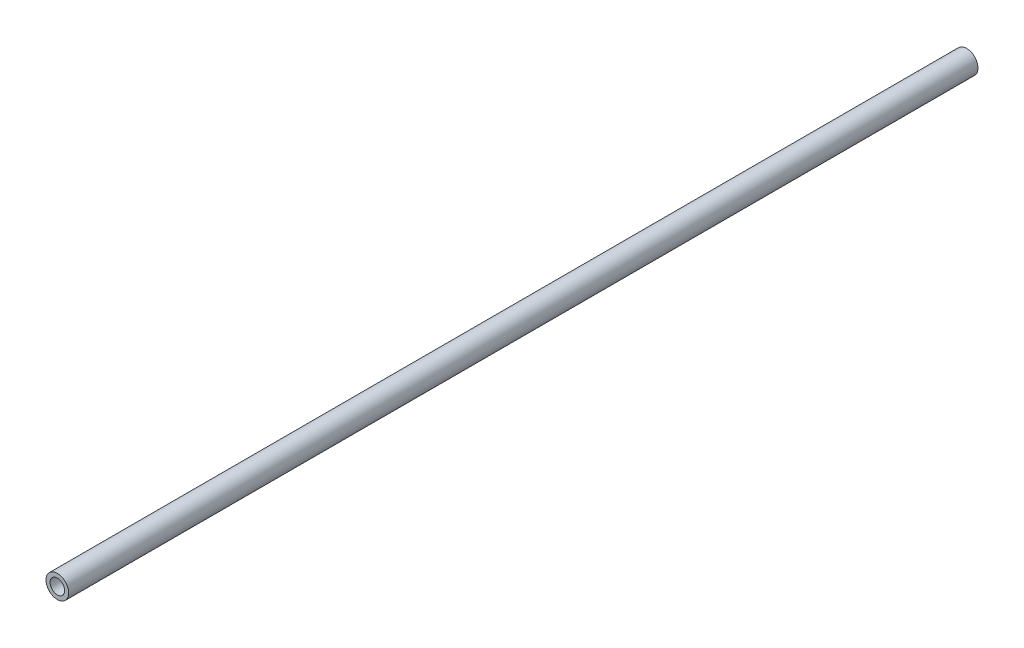
ISO-10303-21;
HEADER;
FILE_DESCRIPTION(('STEP AP214'),'2;1');
FILE_NAME('part.step','',(''),(''),'','','');
FILE_SCHEMA(('AUTOMOTIVE_DESIGN { 1 0 10303 214 1 1 1 1 }'));
ENDSEC;
DATA;
#1=APPLICATION_CONTEXT('core data for automotive mechanical design processes');
#2=APPLICATION_PROTOCOL_DEFINITION('international standard','automotive_design',2000,#1);
#3=PRODUCT_CONTEXT('',#1,'mechanical');
#4=PRODUCT('Part','Part','',(#3));
#5=PRODUCT_RELATED_PRODUCT_CATEGORY('part','',(#4));
#6=PRODUCT_DEFINITION_FORMATION('','',#4);
#7=PRODUCT_DEFINITION_CONTEXT('part definition',#1,'design');
#8=PRODUCT_DEFINITION('design','',#6,#7);
#9=PRODUCT_DEFINITION_SHAPE('','',#8);
#10=(LENGTH_UNIT() NAMED_UNIT(*) SI_UNIT(.MILLI.,.METRE.));
#11=(NAMED_UNIT(*) PLANE_ANGLE_UNIT() SI_UNIT($,.RADIAN.));
#12=(NAMED_UNIT(*) SI_UNIT($,.STERADIAN.) SOLID_ANGLE_UNIT());
#13=UNCERTAINTY_MEASURE_WITH_UNIT(LENGTH_MEASURE(1.E-05),#10,'distance_accuracy_value','');
#14=(GEOMETRIC_REPRESENTATION_CONTEXT(3) GLOBAL_UNCERTAINTY_ASSIGNED_CONTEXT((#13)) GLOBAL_UNIT_ASSIGNED_CONTEXT((#10,
#11,#12)) REPRESENTATION_CONTEXT('',''));
#15=CARTESIAN_POINT('',(0.,0.,0.));
#16=DIRECTION('',(0.,0.,1.));
#17=DIRECTION('',(1.,0.,0.));
#18=AXIS2_PLACEMENT_3D('',#15,#16,#17);
#19=CARTESIAN_POINT('',(0.,0.,200.));
#20=DIRECTION('',(0.,0.,1.));
#21=DIRECTION('',(1.,0.,0.));
#22=AXIS2_PLACEMENT_3D('',#19,#20,#21);
#23=PLANE('',#22);
#24=CARTESIAN_POINT('',(0.,0.,200.));
#25=DIRECTION('',(0.,0.,1.));
#26=DIRECTION('',(1.,0.,0.));
#27=AXIS2_PLACEMENT_3D('',#24,#25,#26);
#28=CIRCLE('',#27,2.5);
#29=CARTESIAN_POINT('',(2.5,0.,200.));
#30=VERTEX_POINT('',#29);
#31=EDGE_CURVE('E10',#30,#30,#28,.T.);
#32=ORIENTED_EDGE('',*,*,#31,.T.);
#33=EDGE_LOOP('',(#32));
#34=FACE_BOUND('',#33,.T.);
#35=CARTESIAN_POINT('',(0.,0.,200.));
#36=DIRECTION('',(0.,0.,1.));
#37=DIRECTION('',(1.,0.,0.));
#38=AXIS2_PLACEMENT_3D('',#35,#36,#37);
#39=CIRCLE('',#38,1.6);
#40=CARTESIAN_POINT('',(1.6,0.,200.));
#41=VERTEX_POINT('',#40);
#42=EDGE_CURVE('E42',#41,#41,#39,.T.);
#43=ORIENTED_EDGE('',*,*,#42,.F.);
#44=EDGE_LOOP('',(#43));
#45=FACE_BOUND('',#44,.T.);
#46=ADVANCED_FACE('F31',(#34,#45),#23,.T.);
#47=CARTESIAN_POINT('',(0.,0.,0.));
#48=DIRECTION('',(0.,0.,1.));
#49=DIRECTION('',(1.,0.,0.));
#50=AXIS2_PLACEMENT_3D('',#47,#48,#49);
#51=PLANE('',#50);
#52=CARTESIAN_POINT('',(0.,0.,0.));
#53=DIRECTION('',(0.,0.,1.));
#54=DIRECTION('',(1.,0.,0.));
#55=AXIS2_PLACEMENT_3D('',#52,#53,#54);
#56=CIRCLE('',#55,2.5);
#57=CARTESIAN_POINT('',(2.5,0.,0.));
#58=VERTEX_POINT('',#57);
#59=EDGE_CURVE('E35',#58,#58,#56,.T.);
#60=ORIENTED_EDGE('',*,*,#59,.F.);
#61=EDGE_LOOP('',(#60));
#62=FACE_BOUND('',#61,.T.);
#63=CARTESIAN_POINT('',(0.,0.,0.));
#64=DIRECTION('',(0.,0.,1.));
#65=DIRECTION('',(1.,0.,0.));
#66=AXIS2_PLACEMENT_3D('',#63,#64,#65);
#67=CIRCLE('',#66,1.6);
#68=CARTESIAN_POINT('',(1.6,0.,0.));
#69=VERTEX_POINT('',#68);
#70=EDGE_CURVE('E44',#69,#69,#67,.T.);
#71=ORIENTED_EDGE('',*,*,#70,.T.);
#72=EDGE_LOOP('',(#71));
#73=FACE_BOUND('',#72,.T.);
#74=ADVANCED_FACE('F54',(#62,#73),#51,.F.);
#75=CARTESIAN_POINT('',(0.,0.,200.));
#76=DIRECTION('',(0.,0.,-1.));
#77=DIRECTION('',(-1.,0.,0.));
#78=AXIS2_PLACEMENT_3D('',#75,#76,#77);
#79=CYLINDRICAL_SURFACE('',#78,2.5);
#80=ORIENTED_EDGE('',*,*,#31,.F.);
#81=EDGE_LOOP('',(#80));
#82=FACE_BOUND('',#81,.T.);
#83=ORIENTED_EDGE('',*,*,#59,.T.);
#84=EDGE_LOOP('',(#83));
#85=FACE_BOUND('',#84,.T.);
#86=ADVANCED_FACE('F33',(#82,#85),#79,.T.);
#87=CARTESIAN_POINT('',(0.,0.,200.));
#88=DIRECTION('',(0.,0.,-1.));
#89=DIRECTION('',(-1.,0.,0.));
#90=AXIS2_PLACEMENT_3D('',#87,#88,#89);
#91=CYLINDRICAL_SURFACE('',#90,1.6);
#92=ORIENTED_EDGE('',*,*,#42,.T.);
#93=EDGE_LOOP('',(#92));
#94=FACE_BOUND('',#93,.T.);
#95=ORIENTED_EDGE('',*,*,#70,.F.);
#96=EDGE_LOOP('',(#95));
#97=FACE_BOUND('',#96,.T.);
#98=ADVANCED_FACE('F50',(#94,#97),#91,.F.);
#99=CLOSED_SHELL('',(#46,#74,#86,#98));
#100=MANIFOLD_SOLID_BREP('B2',#99);
#101=ADVANCED_BREP_SHAPE_REPRESENTATION('',(#18,#100),#14);
#102=SHAPE_DEFINITION_REPRESENTATION(#9,#101);
ENDSEC;
END-ISO-10303-21;
